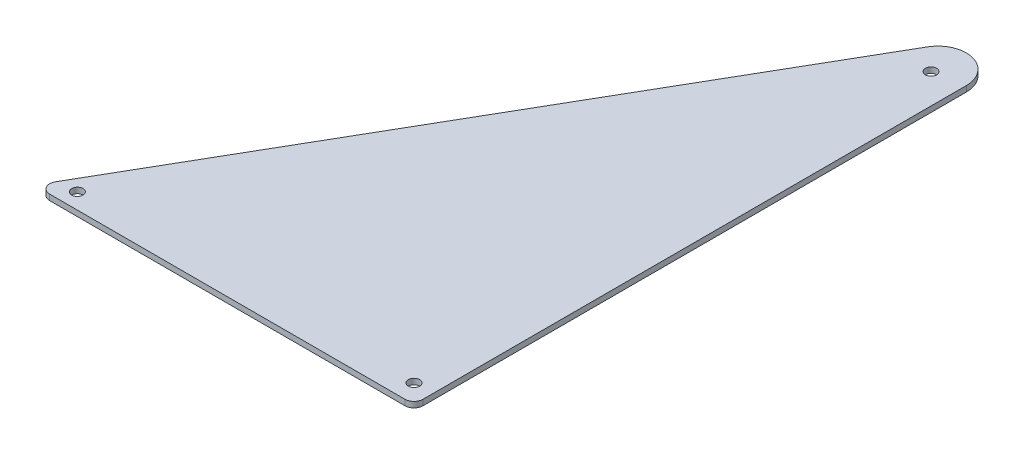
ISO-10303-21;
HEADER;
FILE_DESCRIPTION(('STEP AP214'),'2;1');
FILE_NAME('part.step','',(''),(''),'','','');
FILE_SCHEMA(('AUTOMOTIVE_DESIGN { 1 0 10303 214 1 1 1 1 }'));
ENDSEC;
DATA;
#1=APPLICATION_CONTEXT('core data for automotive mechanical design processes');
#2=APPLICATION_PROTOCOL_DEFINITION('international standard','automotive_design',2000,#1);
#3=PRODUCT_CONTEXT('',#1,'mechanical');
#4=PRODUCT('Part','Part','',(#3));
#5=PRODUCT_RELATED_PRODUCT_CATEGORY('part','',(#4));
#6=PRODUCT_DEFINITION_FORMATION('','',#4);
#7=PRODUCT_DEFINITION_CONTEXT('part definition',#1,'design');
#8=PRODUCT_DEFINITION('design','',#6,#7);
#9=PRODUCT_DEFINITION_SHAPE('','',#8);
#10=(LENGTH_UNIT() NAMED_UNIT(*) SI_UNIT(.MILLI.,.METRE.));
#11=(NAMED_UNIT(*) PLANE_ANGLE_UNIT() SI_UNIT($,.RADIAN.));
#12=(NAMED_UNIT(*) SI_UNIT($,.STERADIAN.) SOLID_ANGLE_UNIT());
#13=UNCERTAINTY_MEASURE_WITH_UNIT(LENGTH_MEASURE(1.E-05),#10,'distance_accuracy_value','');
#14=(GEOMETRIC_REPRESENTATION_CONTEXT(3) GLOBAL_UNCERTAINTY_ASSIGNED_CONTEXT((#13)) GLOBAL_UNIT_ASSIGNED_CONTEXT((#10,
#11,#12)) REPRESENTATION_CONTEXT('',''));
#15=CARTESIAN_POINT('',(0.,0.,0.));
#16=DIRECTION('',(0.,0.,1.));
#17=DIRECTION('',(1.,0.,0.));
#18=AXIS2_PLACEMENT_3D('',#15,#16,#17);
#19=CARTESIAN_POINT('',(0.,3.175,0.));
#20=DIRECTION('',(0.,1.,0.));
#21=DIRECTION('',(0.,0.,1.));
#22=AXIS2_PLACEMENT_3D('',#19,#20,#21);
#23=PLANE('',#22);
#24=CARTESIAN_POINT('',(196.028249531799,3.175,-306.137386971466));
#25=DIRECTION('',(0.,1.,0.));
#26=DIRECTION('',(0.,0.,1.));
#27=AXIS2_PLACEMENT_3D('',#24,#25,#26);
#28=CIRCLE('',#27,3.17499999999997);
#29=CARTESIAN_POINT('',(196.028249531799,3.175,-302.962386971466));
#30=VERTEX_POINT('',#29);
#31=EDGE_CURVE('E112',#30,#30,#28,.T.);
#32=ORIENTED_EDGE('',*,*,#31,.F.);
#33=EDGE_LOOP('',(#32));
#34=FACE_BOUND('',#33,.T.);
#35=CARTESIAN_POINT('',(202.256846327359,3.175,-10.4681536726415));
#36=DIRECTION('',(0.,1.,0.));
#37=DIRECTION('',(0.,0.,1.));
#38=AXIS2_PLACEMENT_3D('',#35,#36,#37);
#39=CIRCLE('',#38,3.17499999999997);
#40=CARTESIAN_POINT('',(202.256846327359,3.175,-7.29315367264151));
#41=VERTEX_POINT('',#40);
#42=EDGE_CURVE('E268',#41,#41,#39,.T.);
#43=ORIENTED_EDGE('',*,*,#42,.F.);
#44=EDGE_LOOP('',(#43));
#45=FACE_BOUND('',#44,.T.);
#46=CARTESIAN_POINT('',(15.3979316792873,3.175,-8.88999999999999));
#47=DIRECTION('',(0.,1.,0.));
#48=DIRECTION('',(0.,0.,1.));
#49=AXIS2_PLACEMENT_3D('',#46,#47,#48);
#50=CIRCLE('',#49,3.175);
#51=CARTESIAN_POINT('',(15.3979316792873,3.175,-5.71499999999999));
#52=VERTEX_POINT('',#51);
#53=EDGE_CURVE('E273',#52,#52,#50,.T.);
#54=ORIENTED_EDGE('',*,*,#53,.F.);
#55=EDGE_LOOP('',(#54));
#56=FACE_BOUND('',#55,.T.);
#57=DIRECTION('',(1.,0.,0.));
#58=VECTOR('',#57,1.);
#59=CARTESIAN_POINT('',(0.,3.175,0.));
#60=LINE('',#59,#58);
#61=CARTESIAN_POINT('',(8.79881810244991,3.175,0.));
#62=VERTEX_POINT('',#61);
#63=CARTESIAN_POINT('',(207.645,3.175,0.));
#64=VERTEX_POINT('',#63);
#65=EDGE_CURVE('E129',#62,#64,#60,.T.);
#66=ORIENTED_EDGE('',*,*,#65,.T.);
#67=CARTESIAN_POINT('',(207.645,3.175,-5.08));
#68=DIRECTION('',(0.,1.,0.));
#69=DIRECTION('',(0.,0.,1.));
#70=AXIS2_PLACEMENT_3D('',#67,#68,#69);
#71=CIRCLE('',#70,5.08);
#72=CARTESIAN_POINT('',(212.725,3.175,-5.08));
#73=VERTEX_POINT('',#72);
#74=EDGE_CURVE('E62',#64,#73,#71,.T.);
#75=ORIENTED_EDGE('',*,*,#74,.T.);
#76=DIRECTION('',(0.,0.,1.));
#77=VECTOR('',#76,1.);
#78=CARTESIAN_POINT('',(212.725,3.175,0.));
#79=LINE('',#78,#77);
#80=CARTESIAN_POINT('',(212.725,3.175,-309.204201469934));
#81=VERTEX_POINT('',#80);
#82=EDGE_CURVE('E103',#81,#73,#79,.T.);
#83=ORIENTED_EDGE('',*,*,#82,.F.);
#84=CARTESIAN_POINT('',(196.85,3.175,-309.204201469934));
#85=DIRECTION('',(0.,1.,0.));
#86=DIRECTION('',(0.,0.,1.));
#87=AXIS2_PLACEMENT_3D('',#84,#85,#86);
#88=CIRCLE('',#87,15.875);
#89=CARTESIAN_POINT('',(183.101846714922,3.175,-317.141701469934));
#90=VERTEX_POINT('',#89);
#91=EDGE_CURVE('E92',#81,#90,#88,.T.);
#92=ORIENTED_EDGE('',*,*,#91,.T.);
#93=DIRECTION('',(-0.5,0.,0.866025403784439));
#94=VECTOR('',#93,1.);
#95=CARTESIAN_POINT('',(196.85,3.175,-340.954201469933));
#96=LINE('',#95,#94);
#97=CARTESIAN_POINT('',(4.39940905122493,3.175,-7.61999999999996));
#98=VERTEX_POINT('',#97);
#99=EDGE_CURVE('E126',#90,#98,#96,.T.);
#100=ORIENTED_EDGE('',*,*,#99,.T.);
#101=CARTESIAN_POINT('',(8.79881810244991,3.175,-5.08));
#102=DIRECTION('',(0.,1.,0.));
#103=DIRECTION('',(0.,0.,1.));
#104=AXIS2_PLACEMENT_3D('',#101,#102,#103);
#105=CIRCLE('',#104,5.08);
#106=EDGE_CURVE('E146',#98,#62,#105,.T.);
#107=ORIENTED_EDGE('',*,*,#106,.T.);
#108=EDGE_LOOP('',(#66,#75,#83,#92,#100,#107));
#109=FACE_BOUND('',#108,.T.);
#110=ADVANCED_FACE('F39',(#34,#45,#56,#109),#23,.T.);
#111=CARTESIAN_POINT('',(0.,0.,0.));
#112=DIRECTION('',(0.,1.,0.));
#113=DIRECTION('',(0.,0.,1.));
#114=AXIS2_PLACEMENT_3D('',#111,#112,#113);
#115=PLANE('',#114);
#116=CARTESIAN_POINT('',(196.028249531799,0.,-306.137386971466));
#117=DIRECTION('',(0.,1.,0.));
#118=DIRECTION('',(0.,0.,1.));
#119=AXIS2_PLACEMENT_3D('',#116,#117,#118);
#120=CIRCLE('',#119,3.17499999999997);
#121=CARTESIAN_POINT('',(196.028249531799,0.,-302.962386971466));
#122=VERTEX_POINT('',#121);
#123=EDGE_CURVE('E108',#122,#122,#120,.F.);
#124=ORIENTED_EDGE('',*,*,#123,.F.);
#125=EDGE_LOOP('',(#124));
#126=FACE_BOUND('',#125,.T.);
#127=CARTESIAN_POINT('',(202.256846327359,0.,-10.4681536726415));
#128=DIRECTION('',(0.,1.,0.));
#129=DIRECTION('',(0.,0.,1.));
#130=AXIS2_PLACEMENT_3D('',#127,#128,#129);
#131=CIRCLE('',#130,3.17499999999997);
#132=CARTESIAN_POINT('',(202.256846327359,0.,-7.29315367264151));
#133=VERTEX_POINT('',#132);
#134=EDGE_CURVE('E264',#133,#133,#131,.F.);
#135=ORIENTED_EDGE('',*,*,#134,.F.);
#136=EDGE_LOOP('',(#135));
#137=FACE_BOUND('',#136,.T.);
#138=CARTESIAN_POINT('',(15.3979316792873,0.,-8.88999999999999));
#139=DIRECTION('',(0.,1.,0.));
#140=DIRECTION('',(0.,0.,1.));
#141=AXIS2_PLACEMENT_3D('',#138,#139,#140);
#142=CIRCLE('',#141,3.175);
#143=CARTESIAN_POINT('',(15.3979316792873,0.,-5.71499999999999));
#144=VERTEX_POINT('',#143);
#145=EDGE_CURVE('E115',#144,#144,#142,.F.);
#146=ORIENTED_EDGE('',*,*,#145,.F.);
#147=EDGE_LOOP('',(#146));
#148=FACE_BOUND('',#147,.T.);
#149=DIRECTION('',(0.,0.,-1.));
#150=VECTOR('',#149,1.);
#151=CARTESIAN_POINT('',(212.725,0.,0.));
#152=LINE('',#151,#150);
#153=CARTESIAN_POINT('',(212.725,0.,-5.08));
#154=VERTEX_POINT('',#153);
#155=CARTESIAN_POINT('',(212.725,0.,-309.204201469934));
#156=VERTEX_POINT('',#155);
#157=EDGE_CURVE('E100',#154,#156,#152,.T.);
#158=ORIENTED_EDGE('',*,*,#157,.F.);
#159=CARTESIAN_POINT('',(207.645,0.,-5.08));
#160=DIRECTION('',(0.,1.,0.));
#161=DIRECTION('',(0.,0.,1.));
#162=AXIS2_PLACEMENT_3D('',#159,#160,#161);
#163=CIRCLE('',#162,5.08);
#164=CARTESIAN_POINT('',(207.645,0.,0.));
#165=VERTEX_POINT('',#164);
#166=EDGE_CURVE('E11',#154,#165,#163,.F.);
#167=ORIENTED_EDGE('',*,*,#166,.T.);
#168=DIRECTION('',(1.,0.,0.));
#169=VECTOR('',#168,1.);
#170=CARTESIAN_POINT('',(0.,0.,0.));
#171=LINE('',#170,#169);
#172=CARTESIAN_POINT('',(8.79881810244991,0.,0.));
#173=VERTEX_POINT('',#172);
#174=EDGE_CURVE('E130',#173,#165,#171,.T.);
#175=ORIENTED_EDGE('',*,*,#174,.F.);
#176=CARTESIAN_POINT('',(8.79881810244991,0.,-5.08));
#177=DIRECTION('',(0.,1.,0.));
#178=DIRECTION('',(0.,0.,1.));
#179=AXIS2_PLACEMENT_3D('',#176,#177,#178);
#180=CIRCLE('',#179,5.08);
#181=CARTESIAN_POINT('',(4.39940905122493,0.,-7.61999999999996));
#182=VERTEX_POINT('',#181);
#183=EDGE_CURVE('E142',#173,#182,#180,.F.);
#184=ORIENTED_EDGE('',*,*,#183,.T.);
#185=DIRECTION('',(-0.5,0.,0.866025403784439));
#186=VECTOR('',#185,1.);
#187=CARTESIAN_POINT('',(196.85,0.,-340.954201469933));
#188=LINE('',#187,#186);
#189=CARTESIAN_POINT('',(183.101846714922,0.,-317.141701469934));
#190=VERTEX_POINT('',#189);
#191=EDGE_CURVE('E122',#190,#182,#188,.T.);
#192=ORIENTED_EDGE('',*,*,#191,.F.);
#193=CARTESIAN_POINT('',(196.85,0.,-309.204201469934));
#194=DIRECTION('',(0.,1.,0.));
#195=DIRECTION('',(0.,0.,1.));
#196=AXIS2_PLACEMENT_3D('',#193,#194,#195);
#197=CIRCLE('',#196,15.875);
#198=EDGE_CURVE('E120',#190,#156,#197,.F.);
#199=ORIENTED_EDGE('',*,*,#198,.T.);
#200=EDGE_LOOP('',(#158,#167,#175,#184,#192,#199));
#201=FACE_BOUND('',#200,.T.);
#202=ADVANCED_FACE('F172',(#126,#137,#148,#201),#115,.F.);
#203=CARTESIAN_POINT('',(196.85,3.175,-340.954201469933));
#204=DIRECTION('',(0.866025403784439,0.,0.5));
#205=DIRECTION('',(0.5,0.,-0.866025403784439));
#206=AXIS2_PLACEMENT_3D('',#203,#204,#205);
#207=PLANE('',#206);
#208=DIRECTION('',(0.,1.,0.));
#209=VECTOR('',#208,1.);
#210=CARTESIAN_POINT('',(183.101846714922,-364.358518173279,-317.141701469934));
#211=LINE('',#210,#209);
#212=EDGE_CURVE('E97',#190,#90,#211,.T.);
#213=ORIENTED_EDGE('',*,*,#212,.F.);
#214=ORIENTED_EDGE('',*,*,#191,.T.);
#215=DIRECTION('',(0.,-1.,0.));
#216=VECTOR('',#215,1.);
#217=CARTESIAN_POINT('',(4.39940905122499,3.175,-7.62000000000002));
#218=LINE('',#217,#216);
#219=EDGE_CURVE('E133',#182,#98,#218,.F.);
#220=ORIENTED_EDGE('',*,*,#219,.T.);
#221=ORIENTED_EDGE('',*,*,#99,.F.);
#222=EDGE_LOOP('',(#213,#214,#220,#221));
#223=FACE_BOUND('',#222,.T.);
#224=ADVANCED_FACE('F190',(#223),#207,.F.);
#225=CARTESIAN_POINT('',(0.,3.175,0.));
#226=DIRECTION('',(0.,0.,-1.));
#227=DIRECTION('',(-1.,0.,0.));
#228=AXIS2_PLACEMENT_3D('',#225,#226,#227);
#229=PLANE('',#228);
#230=ORIENTED_EDGE('',*,*,#174,.T.);
#231=DIRECTION('',(0.,1.,0.));
#232=VECTOR('',#231,1.);
#233=CARTESIAN_POINT('',(207.645,3.175,0.));
#234=LINE('',#233,#232);
#235=EDGE_CURVE('E153',#165,#64,#234,.T.);
#236=ORIENTED_EDGE('',*,*,#235,.T.);
#237=ORIENTED_EDGE('',*,*,#65,.F.);
#238=DIRECTION('',(0.,-1.,0.));
#239=VECTOR('',#238,1.);
#240=CARTESIAN_POINT('',(8.79881810244991,3.175,0.));
#241=LINE('',#240,#239);
#242=EDGE_CURVE('E149',#62,#173,#241,.T.);
#243=ORIENTED_EDGE('',*,*,#242,.T.);
#244=EDGE_LOOP('',(#230,#236,#237,#243));
#245=FACE_BOUND('',#244,.T.);
#246=ADVANCED_FACE('F162',(#245),#229,.F.);
#247=CARTESIAN_POINT('',(8.79881810244991,3.175,-5.08));
#248=DIRECTION('',(0.,-1.,0.));
#249=DIRECTION('',(0.,0.,-1.));
#250=AXIS2_PLACEMENT_3D('',#247,#248,#249);
#251=CYLINDRICAL_SURFACE('',#250,5.08);
#252=ORIENTED_EDGE('',*,*,#106,.F.);
#253=ORIENTED_EDGE('',*,*,#219,.F.);
#254=ORIENTED_EDGE('',*,*,#183,.F.);
#255=ORIENTED_EDGE('',*,*,#242,.F.);
#256=EDGE_LOOP('',(#252,#253,#254,#255));
#257=FACE_BOUND('',#256,.T.);
#258=ADVANCED_FACE('F170',(#257),#251,.T.);
#259=CARTESIAN_POINT('',(196.85,-364.358518173279,-309.204201469934));
#260=DIRECTION('',(0.,1.,0.));
#261=DIRECTION('',(0.,0.,1.));
#262=AXIS2_PLACEMENT_3D('',#259,#260,#261);
#263=CYLINDRICAL_SURFACE('',#262,15.875);
#264=ORIENTED_EDGE('',*,*,#212,.T.);
#265=ORIENTED_EDGE('',*,*,#91,.F.);
#266=DIRECTION('',(0.,1.,0.));
#267=VECTOR('',#266,1.);
#268=CARTESIAN_POINT('',(212.725,-364.358518173279,-309.204201469934));
#269=LINE('',#268,#267);
#270=EDGE_CURVE('E95',#156,#81,#269,.T.);
#271=ORIENTED_EDGE('',*,*,#270,.F.);
#272=ORIENTED_EDGE('',*,*,#198,.F.);
#273=EDGE_LOOP('',(#264,#265,#271,#272));
#274=FACE_BOUND('',#273,.T.);
#275=ADVANCED_FACE('F94',(#274),#263,.T.);
#276=CARTESIAN_POINT('',(212.725,-364.358518173279,0.));
#277=DIRECTION('',(-1.,0.,0.));
#278=DIRECTION('',(0.,0.,1.));
#279=AXIS2_PLACEMENT_3D('',#276,#277,#278);
#280=PLANE('',#279);
#281=ORIENTED_EDGE('',*,*,#82,.T.);
#282=DIRECTION('',(0.,1.,0.));
#283=VECTOR('',#282,1.);
#284=CARTESIAN_POINT('',(212.725,-364.358518173279,-5.08));
#285=LINE('',#284,#283);
#286=EDGE_CURVE('E48',#73,#154,#285,.F.);
#287=ORIENTED_EDGE('',*,*,#286,.T.);
#288=ORIENTED_EDGE('',*,*,#157,.T.);
#289=ORIENTED_EDGE('',*,*,#270,.T.);
#290=EDGE_LOOP('',(#281,#287,#288,#289));
#291=FACE_BOUND('',#290,.T.);
#292=ADVANCED_FACE('F102',(#291),#280,.F.);
#293=CARTESIAN_POINT('',(207.645,3.175,-5.08));
#294=DIRECTION('',(0.,1.,0.));
#295=DIRECTION('',(0.,0.,1.));
#296=AXIS2_PLACEMENT_3D('',#293,#294,#295);
#297=CYLINDRICAL_SURFACE('',#296,5.08);
#298=ORIENTED_EDGE('',*,*,#166,.F.);
#299=ORIENTED_EDGE('',*,*,#286,.F.);
#300=ORIENTED_EDGE('',*,*,#74,.F.);
#301=ORIENTED_EDGE('',*,*,#235,.F.);
#302=EDGE_LOOP('',(#298,#299,#300,#301));
#303=FACE_BOUND('',#302,.T.);
#304=ADVANCED_FACE('F41',(#303),#297,.T.);
#305=CARTESIAN_POINT('',(15.3979316792873,-8.98025612106915,-8.88999999999999));
#306=DIRECTION('',(0.,1.,0.));
#307=DIRECTION('',(0.,0.,1.));
#308=AXIS2_PLACEMENT_3D('',#305,#306,#307);
#309=CYLINDRICAL_SURFACE('',#308,3.175);
#310=ORIENTED_EDGE('',*,*,#145,.T.);
#311=EDGE_LOOP('',(#310));
#312=FACE_BOUND('',#311,.T.);
#313=ORIENTED_EDGE('',*,*,#53,.T.);
#314=EDGE_LOOP('',(#313));
#315=FACE_BOUND('',#314,.T.);
#316=ADVANCED_FACE('F175',(#312,#315),#309,.F.);
#317=CARTESIAN_POINT('',(202.256846327359,-8.98025612106915,-10.4681536726415));
#318=DIRECTION('',(0.,1.,0.));
#319=DIRECTION('',(0.,0.,1.));
#320=AXIS2_PLACEMENT_3D('',#317,#318,#319);
#321=CYLINDRICAL_SURFACE('',#320,3.17499999999997);
#322=ORIENTED_EDGE('',*,*,#134,.T.);
#323=EDGE_LOOP('',(#322));
#324=FACE_BOUND('',#323,.T.);
#325=ORIENTED_EDGE('',*,*,#42,.T.);
#326=EDGE_LOOP('',(#325));
#327=FACE_BOUND('',#326,.T.);
#328=ADVANCED_FACE('F180',(#324,#327),#321,.F.);
#329=CARTESIAN_POINT('',(196.028249531799,-8.98025612106915,-306.137386971466));
#330=DIRECTION('',(0.,1.,0.));
#331=DIRECTION('',(0.,0.,1.));
#332=AXIS2_PLACEMENT_3D('',#329,#330,#331);
#333=CYLINDRICAL_SURFACE('',#332,3.17499999999997);
#334=ORIENTED_EDGE('',*,*,#123,.T.);
#335=EDGE_LOOP('',(#334));
#336=FACE_BOUND('',#335,.T.);
#337=ORIENTED_EDGE('',*,*,#31,.T.);
#338=EDGE_LOOP('',(#337));
#339=FACE_BOUND('',#338,.T.);
#340=ADVANCED_FACE('F246',(#336,#339),#333,.F.);
#341=CLOSED_SHELL('',(#110,#202,#224,#246,#258,#275,#292,#304,#316,#328,#340));
#342=MANIFOLD_SOLID_BREP('B2',#341);
#343=ADVANCED_BREP_SHAPE_REPRESENTATION('',(#18,#342),#14);
#344=SHAPE_DEFINITION_REPRESENTATION(#9,#343);
ENDSEC;
END-ISO-10303-21;
